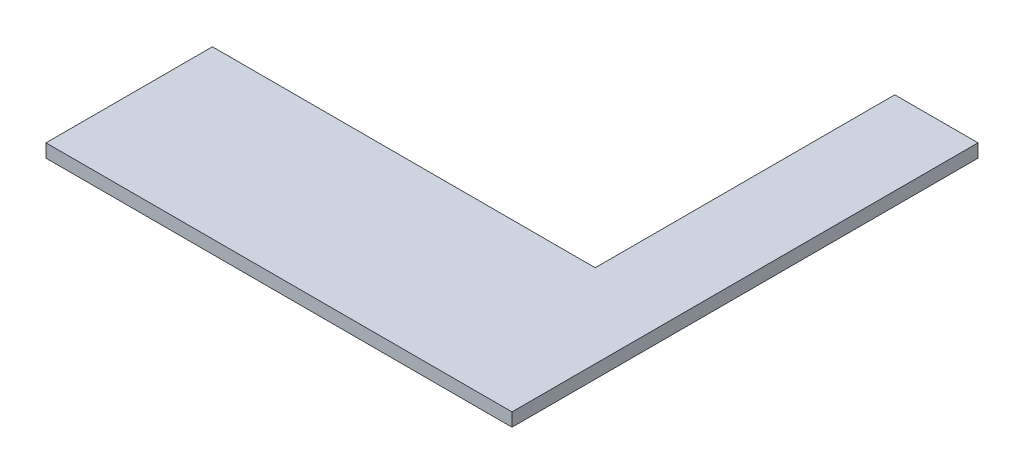
ISO-10303-21;
HEADER;
FILE_DESCRIPTION(('STEP AP214'),'2;1');
FILE_NAME('part.step','',(''),(''),'','','');
FILE_SCHEMA(('AUTOMOTIVE_DESIGN { 1 0 10303 214 1 1 1 1 }'));
ENDSEC;
DATA;
#1=APPLICATION_CONTEXT('core data for automotive mechanical design processes');
#2=APPLICATION_PROTOCOL_DEFINITION('international standard','automotive_design',2000,#1);
#3=PRODUCT_CONTEXT('',#1,'mechanical');
#4=PRODUCT('Part','Part','',(#3));
#5=PRODUCT_RELATED_PRODUCT_CATEGORY('part','',(#4));
#6=PRODUCT_DEFINITION_FORMATION('','',#4);
#7=PRODUCT_DEFINITION_CONTEXT('part definition',#1,'design');
#8=PRODUCT_DEFINITION('design','',#6,#7);
#9=PRODUCT_DEFINITION_SHAPE('','',#8);
#10=(LENGTH_UNIT() NAMED_UNIT(*) SI_UNIT(.MILLI.,.METRE.));
#11=(NAMED_UNIT(*) PLANE_ANGLE_UNIT() SI_UNIT($,.RADIAN.));
#12=(NAMED_UNIT(*) SI_UNIT($,.STERADIAN.) SOLID_ANGLE_UNIT());
#13=UNCERTAINTY_MEASURE_WITH_UNIT(LENGTH_MEASURE(1.E-05),#10,'distance_accuracy_value','');
#14=(GEOMETRIC_REPRESENTATION_CONTEXT(3) GLOBAL_UNCERTAINTY_ASSIGNED_CONTEXT((#13)) GLOBAL_UNIT_ASSIGNED_CONTEXT((#10,
#11,#12)) REPRESENTATION_CONTEXT('',''));
#15=CARTESIAN_POINT('',(0.,0.,0.));
#16=DIRECTION('',(0.,0.,1.));
#17=DIRECTION('',(1.,0.,0.));
#18=AXIS2_PLACEMENT_3D('',#15,#16,#17);
#19=CARTESIAN_POINT('',(0.,4.,-140.));
#20=DIRECTION('',(-1.,0.,0.));
#21=DIRECTION('',(0.,0.,1.));
#22=AXIS2_PLACEMENT_3D('',#19,#20,#21);
#23=PLANE('',#22);
#24=DIRECTION('',(0.,0.,-1.));
#25=VECTOR('',#24,1.);
#26=CARTESIAN_POINT('',(0.,0.,-140.));
#27=LINE('',#26,#25);
#28=CARTESIAN_POINT('',(0.,0.,0.));
#29=VERTEX_POINT('',#28);
#30=CARTESIAN_POINT('',(0.,0.,-140.));
#31=VERTEX_POINT('',#30);
#32=EDGE_CURVE('E118',#29,#31,#27,.T.);
#33=ORIENTED_EDGE('',*,*,#32,.T.);
#34=DIRECTION('',(0.,-1.,0.));
#35=VECTOR('',#34,1.);
#36=CARTESIAN_POINT('',(0.,4.,-140.));
#37=LINE('',#36,#35);
#38=CARTESIAN_POINT('',(0.,4.,-140.));
#39=VERTEX_POINT('',#38);
#40=EDGE_CURVE('E11',#39,#31,#37,.T.);
#41=ORIENTED_EDGE('',*,*,#40,.F.);
#42=DIRECTION('',(0.,0.,-1.));
#43=VECTOR('',#42,1.);
#44=CARTESIAN_POINT('',(0.,4.,-140.));
#45=LINE('',#44,#43);
#46=CARTESIAN_POINT('',(0.,4.,0.));
#47=VERTEX_POINT('',#46);
#48=EDGE_CURVE('E128',#47,#39,#45,.T.);
#49=ORIENTED_EDGE('',*,*,#48,.F.);
#50=DIRECTION('',(0.,-1.,0.));
#51=VECTOR('',#50,1.);
#52=CARTESIAN_POINT('',(0.,4.,0.));
#53=LINE('',#52,#51);
#54=EDGE_CURVE('E114',#47,#29,#53,.T.);
#55=ORIENTED_EDGE('',*,*,#54,.T.);
#56=EDGE_LOOP('',(#33,#41,#49,#55));
#57=FACE_BOUND('',#56,.T.);
#58=ADVANCED_FACE('F34',(#57),#23,.F.);
#59=CARTESIAN_POINT('',(-25.,4.,-140.));
#60=DIRECTION('',(0.,0.,1.));
#61=DIRECTION('',(1.,0.,0.));
#62=AXIS2_PLACEMENT_3D('',#59,#60,#61);
#63=PLANE('',#62);
#64=DIRECTION('',(-1.,0.,0.));
#65=VECTOR('',#64,1.);
#66=CARTESIAN_POINT('',(-25.,0.,-140.));
#67=LINE('',#66,#65);
#68=CARTESIAN_POINT('',(-25.,0.,-140.));
#69=VERTEX_POINT('',#68);
#70=EDGE_CURVE('E121',#31,#69,#67,.T.);
#71=ORIENTED_EDGE('',*,*,#70,.T.);
#72=DIRECTION('',(0.,-1.,0.));
#73=VECTOR('',#72,1.);
#74=CARTESIAN_POINT('',(-25.,4.,-140.));
#75=LINE('',#74,#73);
#76=CARTESIAN_POINT('',(-25.,4.,-140.));
#77=VERTEX_POINT('',#76);
#78=EDGE_CURVE('E42',#77,#69,#75,.T.);
#79=ORIENTED_EDGE('',*,*,#78,.F.);
#80=DIRECTION('',(-1.,0.,0.));
#81=VECTOR('',#80,1.);
#82=CARTESIAN_POINT('',(-25.,4.,-140.));
#83=LINE('',#82,#81);
#84=EDGE_CURVE('E87',#39,#77,#83,.T.);
#85=ORIENTED_EDGE('',*,*,#84,.F.);
#86=ORIENTED_EDGE('',*,*,#40,.T.);
#87=EDGE_LOOP('',(#71,#79,#85,#86));
#88=FACE_BOUND('',#87,.T.);
#89=ADVANCED_FACE('F152',(#88),#63,.F.);
#90=CARTESIAN_POINT('',(-25.,4.,-50.));
#91=DIRECTION('',(1.,0.,0.));
#92=DIRECTION('',(0.,0.,-1.));
#93=AXIS2_PLACEMENT_3D('',#90,#91,#92);
#94=PLANE('',#93);
#95=DIRECTION('',(0.,0.,1.));
#96=VECTOR('',#95,1.);
#97=CARTESIAN_POINT('',(-25.,0.,-50.));
#98=LINE('',#97,#96);
#99=CARTESIAN_POINT('',(-25.,0.,-50.));
#100=VERTEX_POINT('',#99);
#101=EDGE_CURVE('E123',#69,#100,#98,.T.);
#102=ORIENTED_EDGE('',*,*,#101,.T.);
#103=DIRECTION('',(0.,-1.,0.));
#104=VECTOR('',#103,1.);
#105=CARTESIAN_POINT('',(-25.,4.,-50.));
#106=LINE('',#105,#104);
#107=CARTESIAN_POINT('',(-25.,4.,-50.));
#108=VERTEX_POINT('',#107);
#109=EDGE_CURVE('E109',#108,#100,#106,.T.);
#110=ORIENTED_EDGE('',*,*,#109,.F.);
#111=DIRECTION('',(0.,0.,1.));
#112=VECTOR('',#111,1.);
#113=CARTESIAN_POINT('',(-25.,4.,-50.));
#114=LINE('',#113,#112);
#115=EDGE_CURVE('E100',#77,#108,#114,.T.);
#116=ORIENTED_EDGE('',*,*,#115,.F.);
#117=ORIENTED_EDGE('',*,*,#78,.T.);
#118=EDGE_LOOP('',(#102,#110,#116,#117));
#119=FACE_BOUND('',#118,.T.);
#120=ADVANCED_FACE('F134',(#119),#94,.F.);
#121=CARTESIAN_POINT('',(-140.,4.,-50.));
#122=DIRECTION('',(0.,0.,1.));
#123=DIRECTION('',(1.,0.,0.));
#124=AXIS2_PLACEMENT_3D('',#121,#122,#123);
#125=PLANE('',#124);
#126=DIRECTION('',(-1.,0.,0.));
#127=VECTOR('',#126,1.);
#128=CARTESIAN_POINT('',(-140.,0.,-50.));
#129=LINE('',#128,#127);
#130=CARTESIAN_POINT('',(-140.,0.,-50.));
#131=VERTEX_POINT('',#130);
#132=EDGE_CURVE('E108',#100,#131,#129,.T.);
#133=ORIENTED_EDGE('',*,*,#132,.T.);
#134=DIRECTION('',(0.,-1.,0.));
#135=VECTOR('',#134,1.);
#136=CARTESIAN_POINT('',(-140.,4.,-50.));
#137=LINE('',#136,#135);
#138=CARTESIAN_POINT('',(-140.,4.,-50.));
#139=VERTEX_POINT('',#138);
#140=EDGE_CURVE('E105',#139,#131,#137,.T.);
#141=ORIENTED_EDGE('',*,*,#140,.F.);
#142=DIRECTION('',(-1.,0.,0.));
#143=VECTOR('',#142,1.);
#144=CARTESIAN_POINT('',(-140.,4.,-50.));
#145=LINE('',#144,#143);
#146=EDGE_CURVE('E94',#108,#139,#145,.T.);
#147=ORIENTED_EDGE('',*,*,#146,.F.);
#148=ORIENTED_EDGE('',*,*,#109,.T.);
#149=EDGE_LOOP('',(#133,#141,#147,#148));
#150=FACE_BOUND('',#149,.T.);
#151=ADVANCED_FACE('F106',(#150),#125,.F.);
#152=CARTESIAN_POINT('',(-140.,4.,0.));
#153=DIRECTION('',(1.,0.,0.));
#154=DIRECTION('',(0.,0.,-1.));
#155=AXIS2_PLACEMENT_3D('',#152,#153,#154);
#156=PLANE('',#155);
#157=DIRECTION('',(0.,0.,1.));
#158=VECTOR('',#157,1.);
#159=CARTESIAN_POINT('',(-140.,0.,0.));
#160=LINE('',#159,#158);
#161=CARTESIAN_POINT('',(-140.,0.,0.));
#162=VERTEX_POINT('',#161);
#163=EDGE_CURVE('E73',#131,#162,#160,.T.);
#164=ORIENTED_EDGE('',*,*,#163,.T.);
#165=DIRECTION('',(0.,-1.,0.));
#166=VECTOR('',#165,1.);
#167=CARTESIAN_POINT('',(-140.,4.,0.));
#168=LINE('',#167,#166);
#169=CARTESIAN_POINT('',(-140.,4.,0.));
#170=VERTEX_POINT('',#169);
#171=EDGE_CURVE('E110',#170,#162,#168,.T.);
#172=ORIENTED_EDGE('',*,*,#171,.F.);
#173=DIRECTION('',(0.,0.,1.));
#174=VECTOR('',#173,1.);
#175=CARTESIAN_POINT('',(-140.,4.,0.));
#176=LINE('',#175,#174);
#177=EDGE_CURVE('E98',#139,#170,#176,.T.);
#178=ORIENTED_EDGE('',*,*,#177,.F.);
#179=ORIENTED_EDGE('',*,*,#140,.T.);
#180=EDGE_LOOP('',(#164,#172,#178,#179));
#181=FACE_BOUND('',#180,.T.);
#182=ADVANCED_FACE('F112',(#181),#156,.F.);
#183=CARTESIAN_POINT('',(0.,4.,0.));
#184=DIRECTION('',(0.,0.,-1.));
#185=DIRECTION('',(-1.,0.,0.));
#186=AXIS2_PLACEMENT_3D('',#183,#184,#185);
#187=PLANE('',#186);
#188=DIRECTION('',(1.,0.,0.));
#189=VECTOR('',#188,1.);
#190=CARTESIAN_POINT('',(0.,0.,0.));
#191=LINE('',#190,#189);
#192=EDGE_CURVE('E79',#162,#29,#191,.T.);
#193=ORIENTED_EDGE('',*,*,#192,.T.);
#194=ORIENTED_EDGE('',*,*,#54,.F.);
#195=DIRECTION('',(1.,0.,0.));
#196=VECTOR('',#195,1.);
#197=CARTESIAN_POINT('',(0.,4.,0.));
#198=LINE('',#197,#196);
#199=EDGE_CURVE('E50',#170,#47,#198,.T.);
#200=ORIENTED_EDGE('',*,*,#199,.F.);
#201=ORIENTED_EDGE('',*,*,#171,.T.);
#202=EDGE_LOOP('',(#193,#194,#200,#201));
#203=FACE_BOUND('',#202,.T.);
#204=ADVANCED_FACE('F141',(#203),#187,.F.);
#205=CARTESIAN_POINT('',(0.,4.,0.));
#206=DIRECTION('',(0.,-1.,0.));
#207=DIRECTION('',(0.,0.,-1.));
#208=AXIS2_PLACEMENT_3D('',#205,#206,#207);
#209=PLANE('',#208);
#210=ORIENTED_EDGE('',*,*,#48,.T.);
#211=ORIENTED_EDGE('',*,*,#84,.T.);
#212=ORIENTED_EDGE('',*,*,#115,.T.);
#213=ORIENTED_EDGE('',*,*,#146,.T.);
#214=ORIENTED_EDGE('',*,*,#177,.T.);
#215=ORIENTED_EDGE('',*,*,#199,.T.);
#216=EDGE_LOOP('',(#210,#211,#212,#213,#214,#215));
#217=FACE_BOUND('',#216,.T.);
#218=ADVANCED_FACE('F96',(#217),#209,.F.);
#219=CARTESIAN_POINT('',(0.,0.,0.));
#220=DIRECTION('',(0.,-1.,0.));
#221=DIRECTION('',(0.,0.,-1.));
#222=AXIS2_PLACEMENT_3D('',#219,#220,#221);
#223=PLANE('',#222);
#224=ORIENTED_EDGE('',*,*,#32,.F.);
#225=ORIENTED_EDGE('',*,*,#192,.F.);
#226=ORIENTED_EDGE('',*,*,#163,.F.);
#227=ORIENTED_EDGE('',*,*,#132,.F.);
#228=ORIENTED_EDGE('',*,*,#101,.F.);
#229=ORIENTED_EDGE('',*,*,#70,.F.);
#230=EDGE_LOOP('',(#224,#225,#226,#227,#228,#229));
#231=FACE_BOUND('',#230,.T.);
#232=ADVANCED_FACE('F137',(#231),#223,.T.);
#233=CLOSED_SHELL('',(#58,#89,#120,#151,#182,#204,#218,#232));
#234=MANIFOLD_SOLID_BREP('B2',#233);
#235=ADVANCED_BREP_SHAPE_REPRESENTATION('',(#18,#234),#14);
#236=SHAPE_DEFINITION_REPRESENTATION(#9,#235);
ENDSEC;
END-ISO-10303-21;
